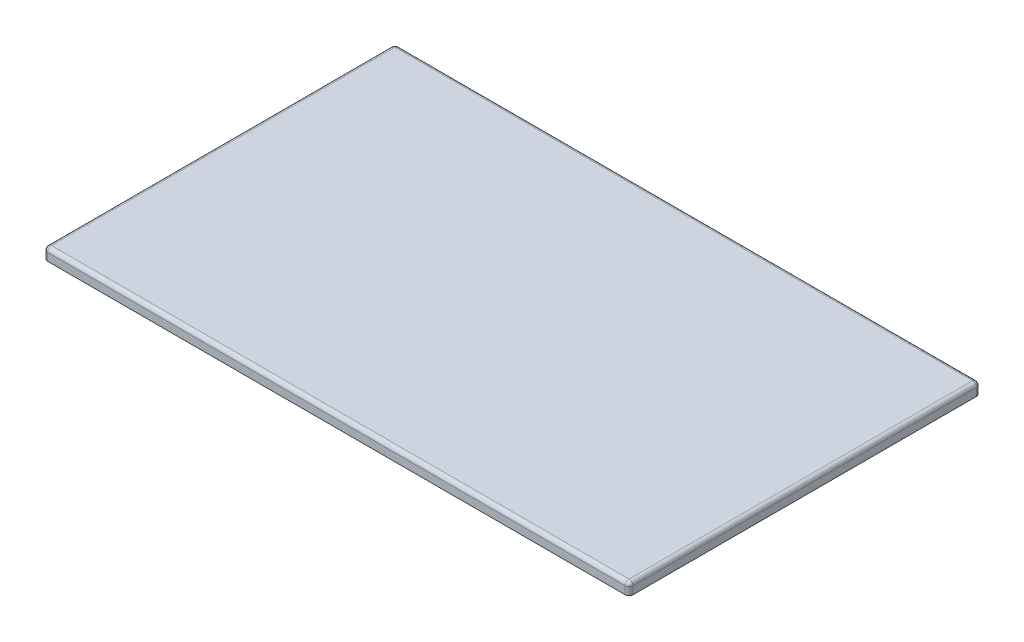
ISO-10303-21;
HEADER;
FILE_DESCRIPTION(('STEP AP214'),'2;1');
FILE_NAME('part.step','',(''),(''),'','','');
FILE_SCHEMA(('AUTOMOTIVE_DESIGN { 1 0 10303 214 1 1 1 1 }'));
ENDSEC;
DATA;
#1=APPLICATION_CONTEXT('core data for automotive mechanical design processes');
#2=APPLICATION_PROTOCOL_DEFINITION('international standard','automotive_design',2000,#1);
#3=PRODUCT_CONTEXT('',#1,'mechanical');
#4=PRODUCT('Part','Part','',(#3));
#5=PRODUCT_RELATED_PRODUCT_CATEGORY('part','',(#4));
#6=PRODUCT_DEFINITION_FORMATION('','',#4);
#7=PRODUCT_DEFINITION_CONTEXT('part definition',#1,'design');
#8=PRODUCT_DEFINITION('design','',#6,#7);
#9=PRODUCT_DEFINITION_SHAPE('','',#8);
#10=(LENGTH_UNIT() NAMED_UNIT(*) SI_UNIT(.MILLI.,.METRE.));
#11=(NAMED_UNIT(*) PLANE_ANGLE_UNIT() SI_UNIT($,.RADIAN.));
#12=(NAMED_UNIT(*) SI_UNIT($,.STERADIAN.) SOLID_ANGLE_UNIT());
#13=UNCERTAINTY_MEASURE_WITH_UNIT(LENGTH_MEASURE(1.E-05),#10,'distance_accuracy_value','');
#14=(GEOMETRIC_REPRESENTATION_CONTEXT(3) GLOBAL_UNCERTAINTY_ASSIGNED_CONTEXT((#13)) GLOBAL_UNIT_ASSIGNED_CONTEXT((#10,
#11,#12)) REPRESENTATION_CONTEXT('',''));
#15=CARTESIAN_POINT('',(0.,0.,0.));
#16=DIRECTION('',(0.,0.,1.));
#17=DIRECTION('',(1.,0.,0.));
#18=AXIS2_PLACEMENT_3D('',#15,#16,#17);
#19=CARTESIAN_POINT('',(0.,30.,0.));
#20=DIRECTION('',(1.,0.,0.));
#21=DIRECTION('',(0.,0.,-1.));
#22=AXIS2_PLACEMENT_3D('',#19,#20,#21);
#23=PLANE('',#22);
#24=DIRECTION('',(0.,0.,1.));
#25=VECTOR('',#24,1.);
#26=CARTESIAN_POINT('',(0.,20.,0.));
#27=LINE('',#26,#25);
#28=CARTESIAN_POINT('',(0.,20.,-10.));
#29=VERTEX_POINT('',#28);
#30=CARTESIAN_POINT('',(0.,20.,-890.));
#31=VERTEX_POINT('',#30);
#32=EDGE_CURVE('E389',#29,#31,#27,.F.);
#33=ORIENTED_EDGE('',*,*,#32,.T.);
#34=DIRECTION('',(0.,-1.,0.));
#35=VECTOR('',#34,1.);
#36=CARTESIAN_POINT('',(0.,30.,-890.));
#37=LINE('',#36,#35);
#38=CARTESIAN_POINT('',(0.,0.,-890.));
#39=VERTEX_POINT('',#38);
#40=EDGE_CURVE('E430',#31,#39,#37,.T.);
#41=ORIENTED_EDGE('',*,*,#40,.T.);
#42=DIRECTION('',(0.,0.,1.));
#43=VECTOR('',#42,1.);
#44=CARTESIAN_POINT('',(0.,0.,0.));
#45=LINE('',#44,#43);
#46=CARTESIAN_POINT('',(0.,0.,-10.));
#47=VERTEX_POINT('',#46);
#48=EDGE_CURVE('E355',#39,#47,#45,.T.);
#49=ORIENTED_EDGE('',*,*,#48,.T.);
#50=DIRECTION('',(0.,-1.,0.));
#51=VECTOR('',#50,1.);
#52=CARTESIAN_POINT('',(0.,30.,-10.));
#53=LINE('',#52,#51);
#54=EDGE_CURVE('E428',#47,#29,#53,.F.);
#55=ORIENTED_EDGE('',*,*,#54,.T.);
#56=EDGE_LOOP('',(#33,#41,#49,#55));
#57=FACE_BOUND('',#56,.T.);
#58=ADVANCED_FACE('F47',(#57),#23,.F.);
#59=CARTESIAN_POINT('',(0.,30.,0.));
#60=DIRECTION('',(0.,0.,-1.));
#61=DIRECTION('',(-1.,0.,0.));
#62=AXIS2_PLACEMENT_3D('',#59,#60,#61);
#63=PLANE('',#62);
#64=DIRECTION('',(1.,0.,0.));
#65=VECTOR('',#64,1.);
#66=CARTESIAN_POINT('',(0.,20.,0.));
#67=LINE('',#66,#65);
#68=CARTESIAN_POINT('',(1490.,20.,0.));
#69=VERTEX_POINT('',#68);
#70=CARTESIAN_POINT('',(10.,20.,0.));
#71=VERTEX_POINT('',#70);
#72=EDGE_CURVE('E386',#69,#71,#67,.F.);
#73=ORIENTED_EDGE('',*,*,#72,.T.);
#74=DIRECTION('',(0.,-1.,0.));
#75=VECTOR('',#74,1.);
#76=CARTESIAN_POINT('',(10.,30.,0.));
#77=LINE('',#76,#75);
#78=CARTESIAN_POINT('',(10.,0.,0.));
#79=VERTEX_POINT('',#78);
#80=EDGE_CURVE('E11',#71,#79,#77,.T.);
#81=ORIENTED_EDGE('',*,*,#80,.T.);
#82=DIRECTION('',(1.,0.,0.));
#83=VECTOR('',#82,1.);
#84=CARTESIAN_POINT('',(0.,0.,0.));
#85=LINE('',#84,#83);
#86=CARTESIAN_POINT('',(1490.,0.,0.));
#87=VERTEX_POINT('',#86);
#88=EDGE_CURVE('E358',#79,#87,#85,.T.);
#89=ORIENTED_EDGE('',*,*,#88,.T.);
#90=DIRECTION('',(0.,-1.,0.));
#91=VECTOR('',#90,1.);
#92=CARTESIAN_POINT('',(1490.,30.,0.));
#93=LINE('',#92,#91);
#94=EDGE_CURVE('E56',#87,#69,#93,.F.);
#95=ORIENTED_EDGE('',*,*,#94,.T.);
#96=EDGE_LOOP('',(#73,#81,#89,#95));
#97=FACE_BOUND('',#96,.T.);
#98=ADVANCED_FACE('F486',(#97),#63,.F.);
#99=CARTESIAN_POINT('',(1500.,30.,0.));
#100=DIRECTION('',(-1.,0.,0.));
#101=DIRECTION('',(0.,0.,1.));
#102=AXIS2_PLACEMENT_3D('',#99,#100,#101);
#103=PLANE('',#102);
#104=DIRECTION('',(0.,0.,-1.));
#105=VECTOR('',#104,1.);
#106=CARTESIAN_POINT('',(1500.,0.,0.));
#107=LINE('',#106,#105);
#108=CARTESIAN_POINT('',(1500.,0.,-10.));
#109=VERTEX_POINT('',#108);
#110=CARTESIAN_POINT('',(1500.,0.,-890.));
#111=VERTEX_POINT('',#110);
#112=EDGE_CURVE('E362',#109,#111,#107,.T.);
#113=ORIENTED_EDGE('',*,*,#112,.T.);
#114=DIRECTION('',(0.,-1.,0.));
#115=VECTOR('',#114,1.);
#116=CARTESIAN_POINT('',(1500.,30.,-890.));
#117=LINE('',#116,#115);
#118=CARTESIAN_POINT('',(1500.,20.,-890.));
#119=VERTEX_POINT('',#118);
#120=EDGE_CURVE('E426',#111,#119,#117,.F.);
#121=ORIENTED_EDGE('',*,*,#120,.T.);
#122=DIRECTION('',(0.,0.,-1.));
#123=VECTOR('',#122,1.);
#124=CARTESIAN_POINT('',(1500.,20.,0.));
#125=LINE('',#124,#123);
#126=CARTESIAN_POINT('',(1500.,20.,-10.));
#127=VERTEX_POINT('',#126);
#128=EDGE_CURVE('E383',#119,#127,#125,.F.);
#129=ORIENTED_EDGE('',*,*,#128,.T.);
#130=DIRECTION('',(0.,-1.,0.));
#131=VECTOR('',#130,1.);
#132=CARTESIAN_POINT('',(1500.,30.,-10.));
#133=LINE('',#132,#131);
#134=EDGE_CURVE('E424',#127,#109,#133,.T.);
#135=ORIENTED_EDGE('',*,*,#134,.T.);
#136=EDGE_LOOP('',(#113,#121,#129,#135));
#137=FACE_BOUND('',#136,.T.);
#138=ADVANCED_FACE('F457',(#137),#103,.F.);
#139=CARTESIAN_POINT('',(0.,30.,-900.));
#140=DIRECTION('',(0.,0.,1.));
#141=DIRECTION('',(1.,0.,0.));
#142=AXIS2_PLACEMENT_3D('',#139,#140,#141);
#143=PLANE('',#142);
#144=DIRECTION('',(-1.,0.,0.));
#145=VECTOR('',#144,1.);
#146=CARTESIAN_POINT('',(0.,20.,-900.));
#147=LINE('',#146,#145);
#148=CARTESIAN_POINT('',(10.,20.,-900.));
#149=VERTEX_POINT('',#148);
#150=CARTESIAN_POINT('',(1490.,20.,-900.));
#151=VERTEX_POINT('',#150);
#152=EDGE_CURVE('E380',#149,#151,#147,.F.);
#153=ORIENTED_EDGE('',*,*,#152,.T.);
#154=DIRECTION('',(0.,-1.,0.));
#155=VECTOR('',#154,1.);
#156=CARTESIAN_POINT('',(1490.,30.,-900.));
#157=LINE('',#156,#155);
#158=CARTESIAN_POINT('',(1490.,0.,-900.));
#159=VERTEX_POINT('',#158);
#160=EDGE_CURVE('E414',#151,#159,#157,.T.);
#161=ORIENTED_EDGE('',*,*,#160,.T.);
#162=DIRECTION('',(-1.,0.,0.));
#163=VECTOR('',#162,1.);
#164=CARTESIAN_POINT('',(0.,0.,-900.));
#165=LINE('',#164,#163);
#166=CARTESIAN_POINT('',(10.,0.,-900.));
#167=VERTEX_POINT('',#166);
#168=EDGE_CURVE('E365',#159,#167,#165,.T.);
#169=ORIENTED_EDGE('',*,*,#168,.T.);
#170=DIRECTION('',(0.,-1.,0.));
#171=VECTOR('',#170,1.);
#172=CARTESIAN_POINT('',(10.,30.,-900.));
#173=LINE('',#172,#171);
#174=EDGE_CURVE('E412',#167,#149,#173,.F.);
#175=ORIENTED_EDGE('',*,*,#174,.T.);
#176=EDGE_LOOP('',(#153,#161,#169,#175));
#177=FACE_BOUND('',#176,.T.);
#178=ADVANCED_FACE('F730',(#177),#143,.F.);
#179=CARTESIAN_POINT('',(0.,30.,0.));
#180=DIRECTION('',(0.,-1.,0.));
#181=DIRECTION('',(0.,0.,-1.));
#182=AXIS2_PLACEMENT_3D('',#179,#180,#181);
#183=PLANE('',#182);
#184=DIRECTION('',(0.,0.,-1.));
#185=VECTOR('',#184,1.);
#186=CARTESIAN_POINT('',(1490.,30.,0.));
#187=LINE('',#186,#185);
#188=CARTESIAN_POINT('',(1490.,30.,-10.));
#189=VERTEX_POINT('',#188);
#190=CARTESIAN_POINT('',(1490.,30.,-890.));
#191=VERTEX_POINT('',#190);
#192=EDGE_CURVE('E374',#189,#191,#187,.T.);
#193=ORIENTED_EDGE('',*,*,#192,.T.);
#194=DIRECTION('',(-1.,0.,0.));
#195=VECTOR('',#194,1.);
#196=CARTESIAN_POINT('',(0.,30.,-890.));
#197=LINE('',#196,#195);
#198=CARTESIAN_POINT('',(10.,30.,-890.));
#199=VERTEX_POINT('',#198);
#200=EDGE_CURVE('E377',#191,#199,#197,.T.);
#201=ORIENTED_EDGE('',*,*,#200,.T.);
#202=DIRECTION('',(0.,0.,1.));
#203=VECTOR('',#202,1.);
#204=CARTESIAN_POINT('',(10.,30.,0.));
#205=LINE('',#204,#203);
#206=CARTESIAN_POINT('',(10.,30.,-10.));
#207=VERTEX_POINT('',#206);
#208=EDGE_CURVE('E368',#199,#207,#205,.T.);
#209=ORIENTED_EDGE('',*,*,#208,.T.);
#210=DIRECTION('',(1.,0.,0.));
#211=VECTOR('',#210,1.);
#212=CARTESIAN_POINT('',(0.,30.,-10.));
#213=LINE('',#212,#211);
#214=EDGE_CURVE('E371',#207,#189,#213,.T.);
#215=ORIENTED_EDGE('',*,*,#214,.T.);
#216=EDGE_LOOP('',(#193,#201,#209,#215));
#217=FACE_BOUND('',#216,.T.);
#218=ADVANCED_FACE('F469',(#217),#183,.F.);
#219=CARTESIAN_POINT('',(0.,0.,0.));
#220=DIRECTION('',(0.,-1.,0.));
#221=DIRECTION('',(0.,0.,-1.));
#222=AXIS2_PLACEMENT_3D('',#219,#220,#221);
#223=PLANE('',#222);
#224=CARTESIAN_POINT('',(100.,0.,-800.));
#225=DIRECTION('',(0.,-1.,0.));
#226=DIRECTION('',(0.,0.,1.));
#227=AXIS2_PLACEMENT_3D('',#224,#225,#226);
#228=CIRCLE('',#227,9.99999999999995);
#229=CARTESIAN_POINT('',(100.,0.,-790.));
#230=VERTEX_POINT('',#229);
#231=CARTESIAN_POINT('',(100.,0.,-810.));
#232=VERTEX_POINT('',#231);
#233=EDGE_CURVE('E64',#230,#232,#228,.T.);
#234=ORIENTED_EDGE('',*,*,#233,.F.);
#235=DIRECTION('',(-1.,0.,0.));
#236=VECTOR('',#235,1.);
#237=CARTESIAN_POINT('',(100.,0.,-790.));
#238=LINE('',#237,#236);
#239=CARTESIAN_POINT('',(150.,0.,-790.));
#240=VERTEX_POINT('',#239);
#241=EDGE_CURVE('E299',#240,#230,#238,.T.);
#242=ORIENTED_EDGE('',*,*,#241,.F.);
#243=CARTESIAN_POINT('',(150.,0.,-800.));
#244=DIRECTION('',(0.,-1.,0.));
#245=DIRECTION('',(0.,0.,1.));
#246=AXIS2_PLACEMENT_3D('',#243,#244,#245);
#247=CIRCLE('',#246,10.);
#248=CARTESIAN_POINT('',(150.,0.,-810.));
#249=VERTEX_POINT('',#248);
#250=EDGE_CURVE('E313',#249,#240,#247,.T.);
#251=ORIENTED_EDGE('',*,*,#250,.F.);
#252=DIRECTION('',(1.,0.,0.));
#253=VECTOR('',#252,1.);
#254=CARTESIAN_POINT('',(100.,0.,-810.));
#255=LINE('',#254,#253);
#256=EDGE_CURVE('E310',#232,#249,#255,.T.);
#257=ORIENTED_EDGE('',*,*,#256,.F.);
#258=EDGE_LOOP('',(#234,#242,#251,#257));
#259=FACE_BOUND('',#258,.T.);
#260=CARTESIAN_POINT('',(1400.,0.,-800.));
#261=DIRECTION('',(0.,-1.,0.));
#262=DIRECTION('',(0.,0.,-1.));
#263=AXIS2_PLACEMENT_3D('',#260,#261,#262);
#264=CIRCLE('',#263,9.99999999999995);
#265=CARTESIAN_POINT('',(1400.,0.,-810.));
#266=VERTEX_POINT('',#265);
#267=CARTESIAN_POINT('',(1400.,0.,-790.));
#268=VERTEX_POINT('',#267);
#269=EDGE_CURVE('E72',#266,#268,#264,.T.);
#270=ORIENTED_EDGE('',*,*,#269,.F.);
#271=DIRECTION('',(1.,0.,0.));
#272=VECTOR('',#271,1.);
#273=CARTESIAN_POINT('',(1400.,0.,-810.));
#274=LINE('',#273,#272);
#275=CARTESIAN_POINT('',(1350.,0.,-810.));
#276=VERTEX_POINT('',#275);
#277=EDGE_CURVE('E269',#276,#266,#274,.T.);
#278=ORIENTED_EDGE('',*,*,#277,.F.);
#279=CARTESIAN_POINT('',(1350.,0.,-800.));
#280=DIRECTION('',(0.,-1.,0.));
#281=DIRECTION('',(0.,0.,-1.));
#282=AXIS2_PLACEMENT_3D('',#279,#280,#281);
#283=CIRCLE('',#282,10.);
#284=CARTESIAN_POINT('',(1350.,0.,-790.));
#285=VERTEX_POINT('',#284);
#286=EDGE_CURVE('E284',#285,#276,#283,.T.);
#287=ORIENTED_EDGE('',*,*,#286,.F.);
#288=DIRECTION('',(-1.,0.,0.));
#289=VECTOR('',#288,1.);
#290=CARTESIAN_POINT('',(1400.,0.,-790.));
#291=LINE('',#290,#289);
#292=EDGE_CURVE('E280',#268,#285,#291,.T.);
#293=ORIENTED_EDGE('',*,*,#292,.F.);
#294=EDGE_LOOP('',(#270,#278,#287,#293));
#295=FACE_BOUND('',#294,.T.);
#296=CARTESIAN_POINT('',(1400.,0.,-100.));
#297=DIRECTION('',(0.,-1.,0.));
#298=DIRECTION('',(0.,0.,1.));
#299=AXIS2_PLACEMENT_3D('',#296,#297,#298);
#300=CIRCLE('',#299,9.99999999999999);
#301=CARTESIAN_POINT('',(1400.,0.,-110.));
#302=VERTEX_POINT('',#301);
#303=CARTESIAN_POINT('',(1400.,0.,-90.));
#304=VERTEX_POINT('',#303);
#305=EDGE_CURVE('E228',#302,#304,#300,.T.);
#306=ORIENTED_EDGE('',*,*,#305,.F.);
#307=DIRECTION('',(1.,0.,0.));
#308=VECTOR('',#307,1.);
#309=CARTESIAN_POINT('',(1400.,0.,-110.));
#310=LINE('',#309,#308);
#311=CARTESIAN_POINT('',(1350.,0.,-110.));
#312=VERTEX_POINT('',#311);
#313=EDGE_CURVE('E245',#312,#302,#310,.T.);
#314=ORIENTED_EDGE('',*,*,#313,.F.);
#315=CARTESIAN_POINT('',(1350.,0.,-99.9999999999999));
#316=DIRECTION('',(0.,-1.,0.));
#317=DIRECTION('',(0.,0.,1.));
#318=AXIS2_PLACEMENT_3D('',#315,#316,#317);
#319=CIRCLE('',#318,10.0000000000001);
#320=CARTESIAN_POINT('',(1350.,0.,-89.9999999999998));
#321=VERTEX_POINT('',#320);
#322=EDGE_CURVE('E248',#321,#312,#319,.T.);
#323=ORIENTED_EDGE('',*,*,#322,.F.);
#324=DIRECTION('',(-1.,0.,0.));
#325=VECTOR('',#324,1.);
#326=CARTESIAN_POINT('',(1400.,0.,-90.));
#327=LINE('',#326,#325);
#328=EDGE_CURVE('E254',#304,#321,#327,.T.);
#329=ORIENTED_EDGE('',*,*,#328,.F.);
#330=EDGE_LOOP('',(#306,#314,#323,#329));
#331=FACE_BOUND('',#330,.T.);
#332=CARTESIAN_POINT('',(100.,0.,-100.));
#333=DIRECTION('',(0.,-1.,0.));
#334=DIRECTION('',(0.,0.,-1.));
#335=AXIS2_PLACEMENT_3D('',#332,#333,#334);
#336=CIRCLE('',#335,9.99999999999999);
#337=CARTESIAN_POINT('',(100.,0.,-90.));
#338=VERTEX_POINT('',#337);
#339=CARTESIAN_POINT('',(100.,0.,-110.));
#340=VERTEX_POINT('',#339);
#341=EDGE_CURVE('E261',#338,#340,#336,.T.);
#342=ORIENTED_EDGE('',*,*,#341,.F.);
#343=DIRECTION('',(-1.,0.,0.));
#344=VECTOR('',#343,1.);
#345=CARTESIAN_POINT('',(100.,0.,-90.));
#346=LINE('',#345,#344);
#347=CARTESIAN_POINT('',(150.,0.,-90.));
#348=VERTEX_POINT('',#347);
#349=EDGE_CURVE('E328',#348,#338,#346,.T.);
#350=ORIENTED_EDGE('',*,*,#349,.F.);
#351=CARTESIAN_POINT('',(150.,0.,-100.));
#352=DIRECTION('',(0.,-1.,0.));
#353=DIRECTION('',(0.,0.,-1.));
#354=AXIS2_PLACEMENT_3D('',#351,#352,#353);
#355=CIRCLE('',#354,10.0000000000001);
#356=CARTESIAN_POINT('',(150.,0.,-110.));
#357=VERTEX_POINT('',#356);
#358=EDGE_CURVE('E342',#357,#348,#355,.T.);
#359=ORIENTED_EDGE('',*,*,#358,.F.);
#360=DIRECTION('',(1.,0.,0.));
#361=VECTOR('',#360,1.);
#362=CARTESIAN_POINT('',(100.,0.,-110.));
#363=LINE('',#362,#361);
#364=EDGE_CURVE('E339',#340,#357,#363,.T.);
#365=ORIENTED_EDGE('',*,*,#364,.F.);
#366=EDGE_LOOP('',(#342,#350,#359,#365));
#367=FACE_BOUND('',#366,.T.);
#368=ORIENTED_EDGE('',*,*,#168,.F.);
#369=CARTESIAN_POINT('',(1490.,0.,-890.));
#370=DIRECTION('',(0.,-1.,0.));
#371=DIRECTION('',(0.,0.,-1.));
#372=AXIS2_PLACEMENT_3D('',#369,#370,#371);
#373=CIRCLE('',#372,10.);
#374=EDGE_CURVE('E422',#159,#111,#373,.T.);
#375=ORIENTED_EDGE('',*,*,#374,.T.);
#376=ORIENTED_EDGE('',*,*,#112,.F.);
#377=CARTESIAN_POINT('',(1490.,0.,-10.));
#378=DIRECTION('',(0.,-1.,0.));
#379=DIRECTION('',(0.,0.,-1.));
#380=AXIS2_PLACEMENT_3D('',#377,#378,#379);
#381=CIRCLE('',#380,10.);
#382=EDGE_CURVE('E416',#109,#87,#381,.T.);
#383=ORIENTED_EDGE('',*,*,#382,.T.);
#384=ORIENTED_EDGE('',*,*,#88,.F.);
#385=CARTESIAN_POINT('',(10.,0.,-10.));
#386=DIRECTION('',(0.,-1.,0.));
#387=DIRECTION('',(0.,0.,-1.));
#388=AXIS2_PLACEMENT_3D('',#385,#386,#387);
#389=CIRCLE('',#388,10.);
#390=EDGE_CURVE('E418',#79,#47,#389,.T.);
#391=ORIENTED_EDGE('',*,*,#390,.T.);
#392=ORIENTED_EDGE('',*,*,#48,.F.);
#393=CARTESIAN_POINT('',(10.,0.,-890.));
#394=DIRECTION('',(0.,-1.,0.));
#395=DIRECTION('',(0.,0.,-1.));
#396=AXIS2_PLACEMENT_3D('',#393,#394,#395);
#397=CIRCLE('',#396,10.);
#398=EDGE_CURVE('E420',#39,#167,#397,.T.);
#399=ORIENTED_EDGE('',*,*,#398,.T.);
#400=EDGE_LOOP('',(#368,#375,#376,#383,#384,#391,#392,#399));
#401=FACE_BOUND('',#400,.T.);
#402=ADVANCED_FACE('F495',(#259,#295,#331,#367,#401),#223,.T.);
#403=CARTESIAN_POINT('',(0.,20.,-10.));
#404=DIRECTION('',(1.,0.,0.));
#405=DIRECTION('',(0.,0.,-1.));
#406=AXIS2_PLACEMENT_3D('',#403,#404,#405);
#407=CYLINDRICAL_SURFACE('',#406,10.);
#408=ORIENTED_EDGE('',*,*,#214,.F.);
#409=CARTESIAN_POINT('',(10.,20.,-10.));
#410=DIRECTION('',(1.,0.,0.));
#411=DIRECTION('',(0.,0.,-1.));
#412=AXIS2_PLACEMENT_3D('',#409,#410,#411);
#413=CIRCLE('',#412,10.);
#414=EDGE_CURVE('E410',#207,#71,#413,.T.);
#415=ORIENTED_EDGE('',*,*,#414,.T.);
#416=ORIENTED_EDGE('',*,*,#72,.F.);
#417=CARTESIAN_POINT('',(1490.,20.,-10.));
#418=DIRECTION('',(1.,0.,0.));
#419=DIRECTION('',(0.,0.,-1.));
#420=AXIS2_PLACEMENT_3D('',#417,#418,#419);
#421=CIRCLE('',#420,10.);
#422=EDGE_CURVE('E408',#69,#189,#421,.F.);
#423=ORIENTED_EDGE('',*,*,#422,.T.);
#424=EDGE_LOOP('',(#408,#415,#416,#423));
#425=FACE_BOUND('',#424,.T.);
#426=ADVANCED_FACE('F482',(#425),#407,.T.);
#427=CARTESIAN_POINT('',(1490.,20.,0.));
#428=DIRECTION('',(0.,0.,-1.));
#429=DIRECTION('',(-1.,0.,0.));
#430=AXIS2_PLACEMENT_3D('',#427,#428,#429);
#431=CYLINDRICAL_SURFACE('',#430,10.);
#432=ORIENTED_EDGE('',*,*,#128,.F.);
#433=CARTESIAN_POINT('',(1490.,20.,-890.));
#434=DIRECTION('',(0.,0.,-1.));
#435=DIRECTION('',(-1.,0.,0.));
#436=AXIS2_PLACEMENT_3D('',#433,#434,#435);
#437=CIRCLE('',#436,10.);
#438=EDGE_CURVE('E401',#119,#191,#437,.F.);
#439=ORIENTED_EDGE('',*,*,#438,.T.);
#440=ORIENTED_EDGE('',*,*,#192,.F.);
#441=CARTESIAN_POINT('',(1490.,20.,-10.));
#442=DIRECTION('',(0.,0.,-1.));
#443=DIRECTION('',(-1.,0.,0.));
#444=AXIS2_PLACEMENT_3D('',#441,#442,#443);
#445=CIRCLE('',#444,10.);
#446=EDGE_CURVE('E398',#189,#127,#445,.T.);
#447=ORIENTED_EDGE('',*,*,#446,.T.);
#448=EDGE_LOOP('',(#432,#439,#440,#447));
#449=FACE_BOUND('',#448,.T.);
#450=ADVANCED_FACE('F455',(#449),#431,.T.);
#451=CARTESIAN_POINT('',(10.,20.,0.));
#452=DIRECTION('',(0.,0.,1.));
#453=DIRECTION('',(1.,0.,0.));
#454=AXIS2_PLACEMENT_3D('',#451,#452,#453);
#455=CYLINDRICAL_SURFACE('',#454,10.);
#456=ORIENTED_EDGE('',*,*,#208,.F.);
#457=CARTESIAN_POINT('',(10.,20.,-890.));
#458=DIRECTION('',(0.,0.,1.));
#459=DIRECTION('',(1.,0.,0.));
#460=AXIS2_PLACEMENT_3D('',#457,#458,#459);
#461=CIRCLE('',#460,10.);
#462=EDGE_CURVE('E406',#199,#31,#461,.T.);
#463=ORIENTED_EDGE('',*,*,#462,.T.);
#464=ORIENTED_EDGE('',*,*,#32,.F.);
#465=CARTESIAN_POINT('',(10.,20.,-10.));
#466=DIRECTION('',(0.,0.,1.));
#467=DIRECTION('',(1.,0.,0.));
#468=AXIS2_PLACEMENT_3D('',#465,#466,#467);
#469=CIRCLE('',#468,10.);
#470=EDGE_CURVE('E403',#29,#207,#469,.F.);
#471=ORIENTED_EDGE('',*,*,#470,.T.);
#472=EDGE_LOOP('',(#456,#463,#464,#471));
#473=FACE_BOUND('',#472,.T.);
#474=ADVANCED_FACE('F479',(#473),#455,.T.);
#475=CARTESIAN_POINT('',(0.,20.,-890.));
#476=DIRECTION('',(-1.,0.,0.));
#477=DIRECTION('',(0.,0.,1.));
#478=AXIS2_PLACEMENT_3D('',#475,#476,#477);
#479=CYLINDRICAL_SURFACE('',#478,10.);
#480=ORIENTED_EDGE('',*,*,#200,.F.);
#481=CARTESIAN_POINT('',(1490.,20.,-890.));
#482=DIRECTION('',(-1.,0.,0.));
#483=DIRECTION('',(0.,0.,1.));
#484=AXIS2_PLACEMENT_3D('',#481,#482,#483);
#485=CIRCLE('',#484,10.);
#486=EDGE_CURVE('E395',#191,#151,#485,.T.);
#487=ORIENTED_EDGE('',*,*,#486,.T.);
#488=ORIENTED_EDGE('',*,*,#152,.F.);
#489=CARTESIAN_POINT('',(10.,20.,-890.));
#490=DIRECTION('',(-1.,0.,0.));
#491=DIRECTION('',(0.,0.,1.));
#492=AXIS2_PLACEMENT_3D('',#489,#490,#491);
#493=CIRCLE('',#492,10.);
#494=EDGE_CURVE('E392',#149,#199,#493,.F.);
#495=ORIENTED_EDGE('',*,*,#494,.T.);
#496=EDGE_LOOP('',(#480,#487,#488,#495));
#497=FACE_BOUND('',#496,.T.);
#498=ADVANCED_FACE('F472',(#497),#479,.T.);
#499=CARTESIAN_POINT('',(1490.,30.,-890.));
#500=DIRECTION('',(0.,-1.,0.));
#501=DIRECTION('',(0.,0.,-1.));
#502=AXIS2_PLACEMENT_3D('',#499,#500,#501);
#503=CYLINDRICAL_SURFACE('',#502,10.);
#504=ORIENTED_EDGE('',*,*,#374,.F.);
#505=ORIENTED_EDGE('',*,*,#160,.F.);
#506=CARTESIAN_POINT('',(1490.,20.,-890.));
#507=DIRECTION('',(0.,1.,0.));
#508=DIRECTION('',(0.,0.,1.));
#509=AXIS2_PLACEMENT_3D('',#506,#507,#508);
#510=CIRCLE('',#509,10.);
#511=EDGE_CURVE('E359',#119,#151,#510,.T.);
#512=ORIENTED_EDGE('',*,*,#511,.F.);
#513=ORIENTED_EDGE('',*,*,#120,.F.);
#514=EDGE_LOOP('',(#504,#505,#512,#513));
#515=FACE_BOUND('',#514,.T.);
#516=ADVANCED_FACE('F462',(#515),#503,.T.);
#517=CARTESIAN_POINT('',(1490.,20.,-890.));
#518=DIRECTION('',(0.,0.,1.));
#519=DIRECTION('',(1.,0.,0.));
#520=AXIS2_PLACEMENT_3D('',#517,#518,#519);
#521=SPHERICAL_SURFACE('',#520,10.);
#522=ORIENTED_EDGE('',*,*,#486,.F.);
#523=ORIENTED_EDGE('',*,*,#438,.F.);
#524=ORIENTED_EDGE('',*,*,#511,.T.);
#525=EDGE_LOOP('',(#522,#523,#524));
#526=FACE_BOUND('',#525,.T.);
#527=ADVANCED_FACE('F466',(#526),#521,.T.);
#528=CARTESIAN_POINT('',(10.,30.,-890.));
#529=DIRECTION('',(0.,-1.,0.));
#530=DIRECTION('',(0.,0.,-1.));
#531=AXIS2_PLACEMENT_3D('',#528,#529,#530);
#532=CYLINDRICAL_SURFACE('',#531,10.);
#533=ORIENTED_EDGE('',*,*,#398,.F.);
#534=ORIENTED_EDGE('',*,*,#40,.F.);
#535=CARTESIAN_POINT('',(10.,20.,-890.));
#536=DIRECTION('',(0.,1.,0.));
#537=DIRECTION('',(0.,0.,1.));
#538=AXIS2_PLACEMENT_3D('',#535,#536,#537);
#539=CIRCLE('',#538,10.);
#540=EDGE_CURVE('E434',#149,#31,#539,.T.);
#541=ORIENTED_EDGE('',*,*,#540,.F.);
#542=ORIENTED_EDGE('',*,*,#174,.F.);
#543=EDGE_LOOP('',(#533,#534,#541,#542));
#544=FACE_BOUND('',#543,.T.);
#545=ADVANCED_FACE('F500',(#544),#532,.T.);
#546=CARTESIAN_POINT('',(10.,20.,-890.));
#547=DIRECTION('',(0.,0.,1.));
#548=DIRECTION('',(1.,0.,0.));
#549=AXIS2_PLACEMENT_3D('',#546,#547,#548);
#550=SPHERICAL_SURFACE('',#549,10.);
#551=ORIENTED_EDGE('',*,*,#540,.T.);
#552=ORIENTED_EDGE('',*,*,#462,.F.);
#553=ORIENTED_EDGE('',*,*,#494,.F.);
#554=EDGE_LOOP('',(#551,#552,#553));
#555=FACE_BOUND('',#554,.T.);
#556=ADVANCED_FACE('F502',(#555),#550,.T.);
#557=CARTESIAN_POINT('',(10.,30.,-10.));
#558=DIRECTION('',(0.,-1.,0.));
#559=DIRECTION('',(0.,0.,-1.));
#560=AXIS2_PLACEMENT_3D('',#557,#558,#559);
#561=CYLINDRICAL_SURFACE('',#560,10.);
#562=ORIENTED_EDGE('',*,*,#390,.F.);
#563=ORIENTED_EDGE('',*,*,#80,.F.);
#564=CARTESIAN_POINT('',(10.,20.,-10.));
#565=DIRECTION('',(0.,1.,0.));
#566=DIRECTION('',(0.,0.,1.));
#567=AXIS2_PLACEMENT_3D('',#564,#565,#566);
#568=CIRCLE('',#567,10.);
#569=EDGE_CURVE('E436',#29,#71,#568,.T.);
#570=ORIENTED_EDGE('',*,*,#569,.F.);
#571=ORIENTED_EDGE('',*,*,#54,.F.);
#572=EDGE_LOOP('',(#562,#563,#570,#571));
#573=FACE_BOUND('',#572,.T.);
#574=ADVANCED_FACE('F490',(#573),#561,.T.);
#575=CARTESIAN_POINT('',(10.,20.,-10.));
#576=DIRECTION('',(0.,0.,1.));
#577=DIRECTION('',(1.,0.,0.));
#578=AXIS2_PLACEMENT_3D('',#575,#576,#577);
#579=SPHERICAL_SURFACE('',#578,10.);
#580=ORIENTED_EDGE('',*,*,#569,.T.);
#581=ORIENTED_EDGE('',*,*,#414,.F.);
#582=ORIENTED_EDGE('',*,*,#470,.F.);
#583=EDGE_LOOP('',(#580,#581,#582));
#584=FACE_BOUND('',#583,.T.);
#585=ADVANCED_FACE('F509',(#584),#579,.T.);
#586=CARTESIAN_POINT('',(1490.,30.,-10.));
#587=DIRECTION('',(0.,-1.,0.));
#588=DIRECTION('',(0.,0.,-1.));
#589=AXIS2_PLACEMENT_3D('',#586,#587,#588);
#590=CYLINDRICAL_SURFACE('',#589,10.);
#591=ORIENTED_EDGE('',*,*,#382,.F.);
#592=ORIENTED_EDGE('',*,*,#134,.F.);
#593=CARTESIAN_POINT('',(1490.,20.,-10.));
#594=DIRECTION('',(0.,1.,0.));
#595=DIRECTION('',(0.,0.,1.));
#596=AXIS2_PLACEMENT_3D('',#593,#594,#595);
#597=CIRCLE('',#596,10.);
#598=EDGE_CURVE('E51',#69,#127,#597,.T.);
#599=ORIENTED_EDGE('',*,*,#598,.F.);
#600=ORIENTED_EDGE('',*,*,#94,.F.);
#601=EDGE_LOOP('',(#591,#592,#599,#600));
#602=FACE_BOUND('',#601,.T.);
#603=ADVANCED_FACE('F49',(#602),#590,.T.);
#604=CARTESIAN_POINT('',(1490.,20.,-10.));
#605=DIRECTION('',(0.,0.,1.));
#606=DIRECTION('',(1.,0.,0.));
#607=AXIS2_PLACEMENT_3D('',#604,#605,#606);
#608=SPHERICAL_SURFACE('',#607,10.);
#609=ORIENTED_EDGE('',*,*,#446,.F.);
#610=ORIENTED_EDGE('',*,*,#422,.F.);
#611=ORIENTED_EDGE('',*,*,#598,.T.);
#612=EDGE_LOOP('',(#609,#610,#611));
#613=FACE_BOUND('',#612,.T.);
#614=ADVANCED_FACE('F446',(#613),#608,.T.);
#615=CARTESIAN_POINT('',(100.,15.,-100.));
#616=DIRECTION('',(0.,-1.,0.));
#617=DIRECTION('',(0.,0.,-1.));
#618=AXIS2_PLACEMENT_3D('',#615,#616,#617);
#619=CYLINDRICAL_SURFACE('',#618,9.99999999999999);
#620=ORIENTED_EDGE('',*,*,#341,.T.);
#621=DIRECTION('',(0.,-1.,0.));
#622=VECTOR('',#621,1.);
#623=CARTESIAN_POINT('',(100.,15.,-110.));
#624=LINE('',#623,#622);
#625=CARTESIAN_POINT('',(100.,15.,-110.));
#626=VERTEX_POINT('',#625);
#627=EDGE_CURVE('E337',#626,#340,#624,.T.);
#628=ORIENTED_EDGE('',*,*,#627,.F.);
#629=CARTESIAN_POINT('',(100.,15.,-100.));
#630=DIRECTION('',(0.,-1.,0.));
#631=DIRECTION('',(0.,0.,-1.));
#632=AXIS2_PLACEMENT_3D('',#629,#630,#631);
#633=CIRCLE('',#632,9.99999999999999);
#634=CARTESIAN_POINT('',(100.,15.,-90.));
#635=VERTEX_POINT('',#634);
#636=EDGE_CURVE('E324',#635,#626,#633,.T.);
#637=ORIENTED_EDGE('',*,*,#636,.F.);
#638=DIRECTION('',(0.,-1.,0.));
#639=VECTOR('',#638,1.);
#640=CARTESIAN_POINT('',(100.,15.,-90.));
#641=LINE('',#640,#639);
#642=EDGE_CURVE('E347',#635,#338,#641,.T.);
#643=ORIENTED_EDGE('',*,*,#642,.T.);
#644=EDGE_LOOP('',(#620,#628,#637,#643));
#645=FACE_BOUND('',#644,.T.);
#646=ADVANCED_FACE('F573',(#645),#619,.F.);
#647=CARTESIAN_POINT('',(100.,15.,-90.));
#648=DIRECTION('',(0.,0.,1.));
#649=DIRECTION('',(1.,0.,0.));
#650=AXIS2_PLACEMENT_3D('',#647,#648,#649);
#651=PLANE('',#650);
#652=ORIENTED_EDGE('',*,*,#349,.T.);
#653=ORIENTED_EDGE('',*,*,#642,.F.);
#654=DIRECTION('',(-1.,0.,0.));
#655=VECTOR('',#654,1.);
#656=CARTESIAN_POINT('',(100.,15.,-90.));
#657=LINE('',#656,#655);
#658=CARTESIAN_POINT('',(150.,15.,-90.));
#659=VERTEX_POINT('',#658);
#660=EDGE_CURVE('E334',#659,#635,#657,.T.);
#661=ORIENTED_EDGE('',*,*,#660,.F.);
#662=DIRECTION('',(0.,-1.,0.));
#663=VECTOR('',#662,1.);
#664=CARTESIAN_POINT('',(150.,15.,-90.));
#665=LINE('',#664,#663);
#666=EDGE_CURVE('E349',#659,#348,#665,.T.);
#667=ORIENTED_EDGE('',*,*,#666,.T.);
#668=EDGE_LOOP('',(#652,#653,#661,#667));
#669=FACE_BOUND('',#668,.T.);
#670=ADVANCED_FACE('F581',(#669),#651,.F.);
#671=CARTESIAN_POINT('',(150.,15.,-100.));
#672=DIRECTION('',(0.,-1.,0.));
#673=DIRECTION('',(0.,0.,-1.));
#674=AXIS2_PLACEMENT_3D('',#671,#672,#673);
#675=CYLINDRICAL_SURFACE('',#674,10.0000000000001);
#676=ORIENTED_EDGE('',*,*,#358,.T.);
#677=ORIENTED_EDGE('',*,*,#666,.F.);
#678=CARTESIAN_POINT('',(150.,15.,-100.));
#679=DIRECTION('',(0.,-1.,0.));
#680=DIRECTION('',(0.,0.,-1.));
#681=AXIS2_PLACEMENT_3D('',#678,#679,#680);
#682=CIRCLE('',#681,10.0000000000001);
#683=CARTESIAN_POINT('',(150.,15.,-110.));
#684=VERTEX_POINT('',#683);
#685=EDGE_CURVE('E331',#684,#659,#682,.T.);
#686=ORIENTED_EDGE('',*,*,#685,.F.);
#687=DIRECTION('',(0.,-1.,0.));
#688=VECTOR('',#687,1.);
#689=CARTESIAN_POINT('',(150.,15.,-110.));
#690=LINE('',#689,#688);
#691=EDGE_CURVE('E351',#684,#357,#690,.T.);
#692=ORIENTED_EDGE('',*,*,#691,.T.);
#693=EDGE_LOOP('',(#676,#677,#686,#692));
#694=FACE_BOUND('',#693,.T.);
#695=ADVANCED_FACE('F589',(#694),#675,.F.);
#696=CARTESIAN_POINT('',(100.,15.,-110.));
#697=DIRECTION('',(0.,0.,-1.));
#698=DIRECTION('',(-1.,0.,0.));
#699=AXIS2_PLACEMENT_3D('',#696,#697,#698);
#700=PLANE('',#699);
#701=ORIENTED_EDGE('',*,*,#364,.T.);
#702=ORIENTED_EDGE('',*,*,#691,.F.);
#703=DIRECTION('',(1.,0.,0.));
#704=VECTOR('',#703,1.);
#705=CARTESIAN_POINT('',(100.,15.,-110.));
#706=LINE('',#705,#704);
#707=EDGE_CURVE('E327',#626,#684,#706,.T.);
#708=ORIENTED_EDGE('',*,*,#707,.F.);
#709=ORIENTED_EDGE('',*,*,#627,.T.);
#710=EDGE_LOOP('',(#701,#702,#708,#709));
#711=FACE_BOUND('',#710,.T.);
#712=ADVANCED_FACE('F597',(#711),#700,.F.);
#713=CARTESIAN_POINT('',(100.,15.,-100.));
#714=DIRECTION('',(0.,-1.,0.));
#715=DIRECTION('',(0.,0.,-1.));
#716=AXIS2_PLACEMENT_3D('',#713,#714,#715);
#717=PLANE('',#716);
#718=ORIENTED_EDGE('',*,*,#636,.T.);
#719=ORIENTED_EDGE('',*,*,#707,.T.);
#720=ORIENTED_EDGE('',*,*,#685,.T.);
#721=ORIENTED_EDGE('',*,*,#660,.T.);
#722=EDGE_LOOP('',(#718,#719,#720,#721));
#723=FACE_BOUND('',#722,.T.);
#724=ADVANCED_FACE('F605',(#723),#717,.T.);
#725=CARTESIAN_POINT('',(1400.,15.,-100.));
#726=DIRECTION('',(0.,-1.,0.));
#727=DIRECTION('',(0.,0.,-1.));
#728=AXIS2_PLACEMENT_3D('',#725,#726,#727);
#729=CYLINDRICAL_SURFACE('',#728,9.99999999999999);
#730=ORIENTED_EDGE('',*,*,#305,.T.);
#731=DIRECTION('',(0.,-1.,0.));
#732=VECTOR('',#731,1.);
#733=CARTESIAN_POINT('',(1400.,15.,-90.));
#734=LINE('',#733,#732);
#735=CARTESIAN_POINT('',(1400.,15.,-90.));
#736=VERTEX_POINT('',#735);
#737=EDGE_CURVE('E221',#736,#304,#734,.T.);
#738=ORIENTED_EDGE('',*,*,#737,.F.);
#739=CARTESIAN_POINT('',(1400.,15.,-100.));
#740=DIRECTION('',(0.,-1.,0.));
#741=DIRECTION('',(0.,0.,1.));
#742=AXIS2_PLACEMENT_3D('',#739,#740,#741);
#743=CIRCLE('',#742,9.99999999999999);
#744=CARTESIAN_POINT('',(1400.,15.,-110.));
#745=VERTEX_POINT('',#744);
#746=EDGE_CURVE('E225',#745,#736,#743,.T.);
#747=ORIENTED_EDGE('',*,*,#746,.F.);
#748=DIRECTION('',(0.,-1.,0.));
#749=VECTOR('',#748,1.);
#750=CARTESIAN_POINT('',(1400.,15.,-110.));
#751=LINE('',#750,#749);
#752=EDGE_CURVE('E259',#745,#302,#751,.T.);
#753=ORIENTED_EDGE('',*,*,#752,.T.);
#754=EDGE_LOOP('',(#730,#738,#747,#753));
#755=FACE_BOUND('',#754,.T.);
#756=ADVANCED_FACE('F223',(#755),#729,.F.);
#757=CARTESIAN_POINT('',(1400.,15.,-110.));
#758=DIRECTION('',(0.,0.,-1.));
#759=DIRECTION('',(-1.,0.,0.));
#760=AXIS2_PLACEMENT_3D('',#757,#758,#759);
#761=PLANE('',#760);
#762=ORIENTED_EDGE('',*,*,#313,.T.);
#763=ORIENTED_EDGE('',*,*,#752,.F.);
#764=DIRECTION('',(1.,0.,0.));
#765=VECTOR('',#764,1.);
#766=CARTESIAN_POINT('',(1400.,15.,-110.));
#767=LINE('',#766,#765);
#768=CARTESIAN_POINT('',(1350.,15.,-110.));
#769=VERTEX_POINT('',#768);
#770=EDGE_CURVE('E233',#769,#745,#767,.T.);
#771=ORIENTED_EDGE('',*,*,#770,.F.);
#772=DIRECTION('',(0.,-1.,0.));
#773=VECTOR('',#772,1.);
#774=CARTESIAN_POINT('',(1350.,15.,-110.));
#775=LINE('',#774,#773);
#776=EDGE_CURVE('E262',#769,#312,#775,.T.);
#777=ORIENTED_EDGE('',*,*,#776,.T.);
#778=EDGE_LOOP('',(#762,#763,#771,#777));
#779=FACE_BOUND('',#778,.T.);
#780=ADVANCED_FACE('F620',(#779),#761,.F.);
#781=CARTESIAN_POINT('',(1350.,15.,-99.9999999999999));
#782=DIRECTION('',(0.,-1.,0.));
#783=DIRECTION('',(0.,0.,-1.));
#784=AXIS2_PLACEMENT_3D('',#781,#782,#783);
#785=CYLINDRICAL_SURFACE('',#784,10.0000000000001);
#786=ORIENTED_EDGE('',*,*,#322,.T.);
#787=ORIENTED_EDGE('',*,*,#776,.F.);
#788=CARTESIAN_POINT('',(1350.,15.,-99.9999999999999));
#789=DIRECTION('',(0.,-1.,0.));
#790=DIRECTION('',(0.,0.,1.));
#791=AXIS2_PLACEMENT_3D('',#788,#789,#790);
#792=CIRCLE('',#791,10.0000000000001);
#793=CARTESIAN_POINT('',(1350.,15.,-89.9999999999998));
#794=VERTEX_POINT('',#793);
#795=EDGE_CURVE('E241',#794,#769,#792,.T.);
#796=ORIENTED_EDGE('',*,*,#795,.F.);
#797=DIRECTION('',(0.,-1.,0.));
#798=VECTOR('',#797,1.);
#799=CARTESIAN_POINT('',(1350.,15.,-89.9999999999998));
#800=LINE('',#799,#798);
#801=EDGE_CURVE('E232',#794,#321,#800,.T.);
#802=ORIENTED_EDGE('',*,*,#801,.T.);
#803=EDGE_LOOP('',(#786,#787,#796,#802));
#804=FACE_BOUND('',#803,.T.);
#805=ADVANCED_FACE('F627',(#804),#785,.F.);
#806=CARTESIAN_POINT('',(1400.,15.,-90.));
#807=DIRECTION('',(0.,0.,1.));
#808=DIRECTION('',(1.,0.,0.));
#809=AXIS2_PLACEMENT_3D('',#806,#807,#808);
#810=PLANE('',#809);
#811=ORIENTED_EDGE('',*,*,#328,.T.);
#812=ORIENTED_EDGE('',*,*,#801,.F.);
#813=DIRECTION('',(-1.,0.,0.));
#814=VECTOR('',#813,1.);
#815=CARTESIAN_POINT('',(1400.,15.,-90.));
#816=LINE('',#815,#814);
#817=EDGE_CURVE('E236',#736,#794,#816,.T.);
#818=ORIENTED_EDGE('',*,*,#817,.F.);
#819=ORIENTED_EDGE('',*,*,#737,.T.);
#820=EDGE_LOOP('',(#811,#812,#818,#819));
#821=FACE_BOUND('',#820,.T.);
#822=ADVANCED_FACE('F237',(#821),#810,.F.);
#823=CARTESIAN_POINT('',(1400.,15.,-100.));
#824=DIRECTION('',(0.,1.,0.));
#825=DIRECTION('',(0.,0.,1.));
#826=AXIS2_PLACEMENT_3D('',#823,#824,#825);
#827=PLANE('',#826);
#828=ORIENTED_EDGE('',*,*,#746,.T.);
#829=ORIENTED_EDGE('',*,*,#817,.T.);
#830=ORIENTED_EDGE('',*,*,#795,.T.);
#831=ORIENTED_EDGE('',*,*,#770,.T.);
#832=EDGE_LOOP('',(#828,#829,#830,#831));
#833=FACE_BOUND('',#832,.T.);
#834=ADVANCED_FACE('F243',(#833),#827,.F.);
#835=CARTESIAN_POINT('',(1400.,15.,-800.));
#836=DIRECTION('',(0.,-1.,0.));
#837=DIRECTION('',(0.,0.,-1.));
#838=AXIS2_PLACEMENT_3D('',#835,#836,#837);
#839=CYLINDRICAL_SURFACE('',#838,9.99999999999995);
#840=ORIENTED_EDGE('',*,*,#269,.T.);
#841=DIRECTION('',(0.,-1.,0.));
#842=VECTOR('',#841,1.);
#843=CARTESIAN_POINT('',(1400.,15.,-790.));
#844=LINE('',#843,#842);
#845=CARTESIAN_POINT('',(1400.,15.,-790.));
#846=VERTEX_POINT('',#845);
#847=EDGE_CURVE('E278',#846,#268,#844,.T.);
#848=ORIENTED_EDGE('',*,*,#847,.F.);
#849=CARTESIAN_POINT('',(1400.,15.,-800.));
#850=DIRECTION('',(0.,-1.,0.));
#851=DIRECTION('',(0.,0.,-1.));
#852=AXIS2_PLACEMENT_3D('',#849,#850,#851);
#853=CIRCLE('',#852,9.99999999999995);
#854=CARTESIAN_POINT('',(1400.,15.,-810.));
#855=VERTEX_POINT('',#854);
#856=EDGE_CURVE('E265',#855,#846,#853,.T.);
#857=ORIENTED_EDGE('',*,*,#856,.F.);
#858=DIRECTION('',(0.,-1.,0.));
#859=VECTOR('',#858,1.);
#860=CARTESIAN_POINT('',(1400.,15.,-810.));
#861=LINE('',#860,#859);
#862=EDGE_CURVE('E255',#855,#266,#861,.T.);
#863=ORIENTED_EDGE('',*,*,#862,.T.);
#864=EDGE_LOOP('',(#840,#848,#857,#863));
#865=FACE_BOUND('',#864,.T.);
#866=ADVANCED_FACE('F648',(#865),#839,.F.);
#867=CARTESIAN_POINT('',(1400.,15.,-810.));
#868=DIRECTION('',(0.,0.,-1.));
#869=DIRECTION('',(-1.,0.,0.));
#870=AXIS2_PLACEMENT_3D('',#867,#868,#869);
#871=PLANE('',#870);
#872=ORIENTED_EDGE('',*,*,#277,.T.);
#873=ORIENTED_EDGE('',*,*,#862,.F.);
#874=DIRECTION('',(1.,0.,0.));
#875=VECTOR('',#874,1.);
#876=CARTESIAN_POINT('',(1400.,15.,-810.));
#877=LINE('',#876,#875);
#878=CARTESIAN_POINT('',(1350.,15.,-810.));
#879=VERTEX_POINT('',#878);
#880=EDGE_CURVE('E275',#879,#855,#877,.T.);
#881=ORIENTED_EDGE('',*,*,#880,.F.);
#882=DIRECTION('',(0.,-1.,0.));
#883=VECTOR('',#882,1.);
#884=CARTESIAN_POINT('',(1350.,15.,-810.));
#885=LINE('',#884,#883);
#886=EDGE_CURVE('E290',#879,#276,#885,.T.);
#887=ORIENTED_EDGE('',*,*,#886,.T.);
#888=EDGE_LOOP('',(#872,#873,#881,#887));
#889=FACE_BOUND('',#888,.T.);
#890=ADVANCED_FACE('F655',(#889),#871,.F.);
#891=CARTESIAN_POINT('',(1350.,15.,-800.));
#892=DIRECTION('',(0.,-1.,0.));
#893=DIRECTION('',(0.,0.,-1.));
#894=AXIS2_PLACEMENT_3D('',#891,#892,#893);
#895=CYLINDRICAL_SURFACE('',#894,10.);
#896=ORIENTED_EDGE('',*,*,#286,.T.);
#897=ORIENTED_EDGE('',*,*,#886,.F.);
#898=CARTESIAN_POINT('',(1350.,15.,-800.));
#899=DIRECTION('',(0.,-1.,0.));
#900=DIRECTION('',(0.,0.,-1.));
#901=AXIS2_PLACEMENT_3D('',#898,#899,#900);
#902=CIRCLE('',#901,10.);
#903=CARTESIAN_POINT('',(1350.,15.,-790.));
#904=VERTEX_POINT('',#903);
#905=EDGE_CURVE('E272',#904,#879,#902,.T.);
#906=ORIENTED_EDGE('',*,*,#905,.F.);
#907=DIRECTION('',(0.,-1.,0.));
#908=VECTOR('',#907,1.);
#909=CARTESIAN_POINT('',(1350.,15.,-790.));
#910=LINE('',#909,#908);
#911=EDGE_CURVE('E292',#904,#285,#910,.T.);
#912=ORIENTED_EDGE('',*,*,#911,.T.);
#913=EDGE_LOOP('',(#896,#897,#906,#912));
#914=FACE_BOUND('',#913,.T.);
#915=ADVANCED_FACE('F662',(#914),#895,.F.);
#916=CARTESIAN_POINT('',(1400.,15.,-790.));
#917=DIRECTION('',(0.,0.,1.));
#918=DIRECTION('',(1.,0.,0.));
#919=AXIS2_PLACEMENT_3D('',#916,#917,#918);
#920=PLANE('',#919);
#921=ORIENTED_EDGE('',*,*,#292,.T.);
#922=ORIENTED_EDGE('',*,*,#911,.F.);
#923=DIRECTION('',(-1.,0.,0.));
#924=VECTOR('',#923,1.);
#925=CARTESIAN_POINT('',(1400.,15.,-790.));
#926=LINE('',#925,#924);
#927=EDGE_CURVE('E268',#846,#904,#926,.T.);
#928=ORIENTED_EDGE('',*,*,#927,.F.);
#929=ORIENTED_EDGE('',*,*,#847,.T.);
#930=EDGE_LOOP('',(#921,#922,#928,#929));
#931=FACE_BOUND('',#930,.T.);
#932=ADVANCED_FACE('F670',(#931),#920,.F.);
#933=CARTESIAN_POINT('',(1400.,15.,-800.));
#934=DIRECTION('',(0.,-1.,0.));
#935=DIRECTION('',(0.,0.,-1.));
#936=AXIS2_PLACEMENT_3D('',#933,#934,#935);
#937=PLANE('',#936);
#938=ORIENTED_EDGE('',*,*,#856,.T.);
#939=ORIENTED_EDGE('',*,*,#927,.T.);
#940=ORIENTED_EDGE('',*,*,#905,.T.);
#941=ORIENTED_EDGE('',*,*,#880,.T.);
#942=EDGE_LOOP('',(#938,#939,#940,#941));
#943=FACE_BOUND('',#942,.T.);
#944=ADVANCED_FACE('F678',(#943),#937,.T.);
#945=CARTESIAN_POINT('',(100.,15.,-800.));
#946=DIRECTION('',(0.,-1.,0.));
#947=DIRECTION('',(0.,0.,-1.));
#948=AXIS2_PLACEMENT_3D('',#945,#946,#947);
#949=CYLINDRICAL_SURFACE('',#948,9.99999999999995);
#950=ORIENTED_EDGE('',*,*,#233,.T.);
#951=DIRECTION('',(0.,-1.,0.));
#952=VECTOR('',#951,1.);
#953=CARTESIAN_POINT('',(100.,15.,-810.));
#954=LINE('',#953,#952);
#955=CARTESIAN_POINT('',(100.,15.,-810.));
#956=VERTEX_POINT('',#955);
#957=EDGE_CURVE('E308',#956,#232,#954,.T.);
#958=ORIENTED_EDGE('',*,*,#957,.F.);
#959=CARTESIAN_POINT('',(100.,15.,-800.));
#960=DIRECTION('',(0.,-1.,0.));
#961=DIRECTION('',(0.,0.,1.));
#962=AXIS2_PLACEMENT_3D('',#959,#960,#961);
#963=CIRCLE('',#962,9.99999999999995);
#964=CARTESIAN_POINT('',(100.,15.,-790.));
#965=VERTEX_POINT('',#964);
#966=EDGE_CURVE('E295',#965,#956,#963,.T.);
#967=ORIENTED_EDGE('',*,*,#966,.F.);
#968=DIRECTION('',(0.,-1.,0.));
#969=VECTOR('',#968,1.);
#970=CARTESIAN_POINT('',(100.,15.,-790.));
#971=LINE('',#970,#969);
#972=EDGE_CURVE('E281',#965,#230,#971,.T.);
#973=ORIENTED_EDGE('',*,*,#972,.T.);
#974=EDGE_LOOP('',(#950,#958,#967,#973));
#975=FACE_BOUND('',#974,.T.);
#976=ADVANCED_FACE('F686',(#975),#949,.F.);
#977=CARTESIAN_POINT('',(100.,15.,-790.));
#978=DIRECTION('',(0.,0.,1.));
#979=DIRECTION('',(1.,0.,0.));
#980=AXIS2_PLACEMENT_3D('',#977,#978,#979);
#981=PLANE('',#980);
#982=ORIENTED_EDGE('',*,*,#241,.T.);
#983=ORIENTED_EDGE('',*,*,#972,.F.);
#984=DIRECTION('',(-1.,0.,0.));
#985=VECTOR('',#984,1.);
#986=CARTESIAN_POINT('',(100.,15.,-790.));
#987=LINE('',#986,#985);
#988=CARTESIAN_POINT('',(150.,15.,-790.));
#989=VERTEX_POINT('',#988);
#990=EDGE_CURVE('E305',#989,#965,#987,.T.);
#991=ORIENTED_EDGE('',*,*,#990,.F.);
#992=DIRECTION('',(0.,-1.,0.));
#993=VECTOR('',#992,1.);
#994=CARTESIAN_POINT('',(150.,15.,-790.));
#995=LINE('',#994,#993);
#996=EDGE_CURVE('E319',#989,#240,#995,.T.);
#997=ORIENTED_EDGE('',*,*,#996,.T.);
#998=EDGE_LOOP('',(#982,#983,#991,#997));
#999=FACE_BOUND('',#998,.T.);
#1000=ADVANCED_FACE('F694',(#999),#981,.F.);
#1001=CARTESIAN_POINT('',(150.,15.,-800.));
#1002=DIRECTION('',(0.,-1.,0.));
#1003=DIRECTION('',(0.,0.,-1.));
#1004=AXIS2_PLACEMENT_3D('',#1001,#1002,#1003);
#1005=CYLINDRICAL_SURFACE('',#1004,10.);
#1006=ORIENTED_EDGE('',*,*,#250,.T.);
#1007=ORIENTED_EDGE('',*,*,#996,.F.);
#1008=CARTESIAN_POINT('',(150.,15.,-800.));
#1009=DIRECTION('',(0.,-1.,0.));
#1010=DIRECTION('',(0.,0.,1.));
#1011=AXIS2_PLACEMENT_3D('',#1008,#1009,#1010);
#1012=CIRCLE('',#1011,10.);
#1013=CARTESIAN_POINT('',(150.,15.,-810.));
#1014=VERTEX_POINT('',#1013);
#1015=EDGE_CURVE('E302',#1014,#989,#1012,.T.);
#1016=ORIENTED_EDGE('',*,*,#1015,.F.);
#1017=DIRECTION('',(0.,-1.,0.));
#1018=VECTOR('',#1017,1.);
#1019=CARTESIAN_POINT('',(150.,15.,-810.));
#1020=LINE('',#1019,#1018);
#1021=EDGE_CURVE('E321',#1014,#249,#1020,.T.);
#1022=ORIENTED_EDGE('',*,*,#1021,.T.);
#1023=EDGE_LOOP('',(#1006,#1007,#1016,#1022));
#1024=FACE_BOUND('',#1023,.T.);
#1025=ADVANCED_FACE('F701',(#1024),#1005,.F.);
#1026=CARTESIAN_POINT('',(100.,15.,-810.));
#1027=DIRECTION('',(0.,0.,-1.));
#1028=DIRECTION('',(-1.,0.,0.));
#1029=AXIS2_PLACEMENT_3D('',#1026,#1027,#1028);
#1030=PLANE('',#1029);
#1031=ORIENTED_EDGE('',*,*,#256,.T.);
#1032=ORIENTED_EDGE('',*,*,#1021,.F.);
#1033=DIRECTION('',(1.,0.,0.));
#1034=VECTOR('',#1033,1.);
#1035=CARTESIAN_POINT('',(100.,15.,-810.));
#1036=LINE('',#1035,#1034);
#1037=EDGE_CURVE('E298',#956,#1014,#1036,.T.);
#1038=ORIENTED_EDGE('',*,*,#1037,.F.);
#1039=ORIENTED_EDGE('',*,*,#957,.T.);
#1040=EDGE_LOOP('',(#1031,#1032,#1038,#1039));
#1041=FACE_BOUND('',#1040,.T.);
#1042=ADVANCED_FACE('F709',(#1041),#1030,.F.);
#1043=CARTESIAN_POINT('',(100.,15.,-800.));
#1044=DIRECTION('',(0.,1.,0.));
#1045=DIRECTION('',(0.,0.,1.));
#1046=AXIS2_PLACEMENT_3D('',#1043,#1044,#1045);
#1047=PLANE('',#1046);
#1048=ORIENTED_EDGE('',*,*,#966,.T.);
#1049=ORIENTED_EDGE('',*,*,#1037,.T.);
#1050=ORIENTED_EDGE('',*,*,#1015,.T.);
#1051=ORIENTED_EDGE('',*,*,#990,.T.);
#1052=EDGE_LOOP('',(#1048,#1049,#1050,#1051));
#1053=FACE_BOUND('',#1052,.T.);
#1054=ADVANCED_FACE('F717',(#1053),#1047,.F.);
#1055=CLOSED_SHELL('',(#58,#98,#138,#178,#218,#402,#426,#450,#474,#498,#516,#527,#545,#556,#574,
#585,#603,#614,#646,#670,#695,#712,#724,#756,#780,#805,#822,#834,#866,#890,#915,#932,#944,#976,
#1000,#1025,#1042,#1054));
#1056=MANIFOLD_SOLID_BREP('B2',#1055);
#1057=ADVANCED_BREP_SHAPE_REPRESENTATION('',(#18,#1056),#14);
#1058=SHAPE_DEFINITION_REPRESENTATION(#9,#1057);
ENDSEC;
END-ISO-10303-21;
